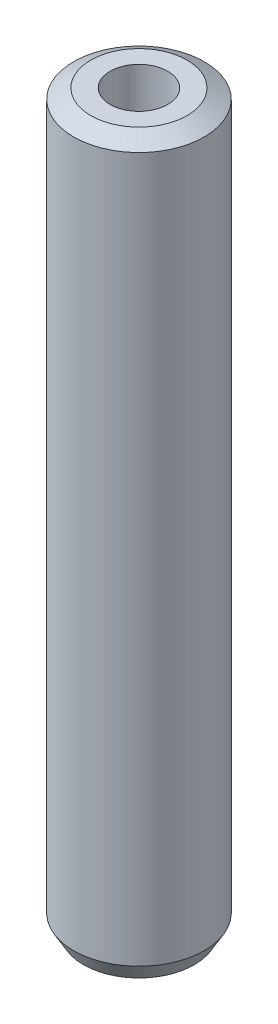
ISO-10303-21;
HEADER;
FILE_DESCRIPTION(('STEP AP214'),'2;1');
FILE_NAME('part.step','',(''),(''),'','','');
FILE_SCHEMA(('AUTOMOTIVE_DESIGN { 1 0 10303 214 1 1 1 1 }'));
ENDSEC;
DATA;
#1=APPLICATION_CONTEXT('core data for automotive mechanical design processes');
#2=APPLICATION_PROTOCOL_DEFINITION('international standard','automotive_design',2000,#1);
#3=PRODUCT_CONTEXT('',#1,'mechanical');
#4=PRODUCT('Part','Part','',(#3));
#5=PRODUCT_RELATED_PRODUCT_CATEGORY('part','',(#4));
#6=PRODUCT_DEFINITION_FORMATION('','',#4);
#7=PRODUCT_DEFINITION_CONTEXT('part definition',#1,'design');
#8=PRODUCT_DEFINITION('design','',#6,#7);
#9=PRODUCT_DEFINITION_SHAPE('','',#8);
#10=(LENGTH_UNIT() NAMED_UNIT(*) SI_UNIT(.MILLI.,.METRE.));
#11=(NAMED_UNIT(*) PLANE_ANGLE_UNIT() SI_UNIT($,.RADIAN.));
#12=(NAMED_UNIT(*) SI_UNIT($,.STERADIAN.) SOLID_ANGLE_UNIT());
#13=UNCERTAINTY_MEASURE_WITH_UNIT(LENGTH_MEASURE(1.E-05),#10,'distance_accuracy_value','');
#14=(GEOMETRIC_REPRESENTATION_CONTEXT(3) GLOBAL_UNCERTAINTY_ASSIGNED_CONTEXT((#13)) GLOBAL_UNIT_ASSIGNED_CONTEXT((#10,
#11,#12)) REPRESENTATION_CONTEXT('',''));
#15=CARTESIAN_POINT('',(0.,0.,0.));
#16=DIRECTION('',(0.,0.,1.));
#17=DIRECTION('',(1.,0.,0.));
#18=AXIS2_PLACEMENT_3D('',#15,#16,#17);
#19=CARTESIAN_POINT('',(0.,224.206713028779,0.));
#20=DIRECTION('',(0.,-1.,0.));
#21=DIRECTION('',(0.,0.,-1.));
#22=AXIS2_PLACEMENT_3D('',#19,#20,#21);
#23=CYLINDRICAL_SURFACE('',#22,20.);
#24=CARTESIAN_POINT('',(0.,221.171537849586,0.));
#25=DIRECTION('',(0.,1.,0.));
#26=DIRECTION('',(0.,0.,1.));
#27=AXIS2_PLACEMENT_3D('',#24,#25,#26);
#28=CIRCLE('',#27,20.);
#29=CARTESIAN_POINT('',(0.,221.171537849586,20.));
#30=VERTEX_POINT('',#29);
#31=EDGE_CURVE('E50',#30,#30,#28,.F.);
#32=ORIENTED_EDGE('',*,*,#31,.T.);
#33=EDGE_LOOP('',(#32));
#34=FACE_BOUND('',#33,.T.);
#35=CARTESIAN_POINT('',(0.,5.25707762023508,0.));
#36=DIRECTION('',(0.,1.,0.));
#37=DIRECTION('',(0.,0.,1.));
#38=AXIS2_PLACEMENT_3D('',#35,#36,#37);
#39=CIRCLE('',#38,20.);
#40=CARTESIAN_POINT('',(0.,5.25707762023508,20.));
#41=VERTEX_POINT('',#40);
#42=EDGE_CURVE('E51',#41,#41,#39,.T.);
#43=ORIENTED_EDGE('',*,*,#42,.T.);
#44=EDGE_LOOP('',(#43));
#45=FACE_BOUND('',#44,.T.);
#46=ADVANCED_FACE('F39',(#34,#45),#23,.T.);
#47=CARTESIAN_POINT('',(0.,224.206713028779,0.));
#48=DIRECTION('',(0.,1.,0.));
#49=DIRECTION('',(0.,0.,1.));
#50=AXIS2_PLACEMENT_3D('',#47,#48,#49);
#51=PLANE('',#50);
#52=CARTESIAN_POINT('',(0.,224.206713028779,0.));
#53=DIRECTION('',(0.,1.,0.));
#54=DIRECTION('',(0.,0.,1.));
#55=AXIS2_PLACEMENT_3D('',#52,#53,#54);
#56=CIRCLE('',#55,14.7429223797649);
#57=CARTESIAN_POINT('',(0.,224.206713028779,14.7429223797649));
#58=VERTEX_POINT('',#57);
#59=EDGE_CURVE('E54',#58,#58,#56,.T.);
#60=ORIENTED_EDGE('',*,*,#59,.T.);
#61=EDGE_LOOP('',(#60));
#62=FACE_BOUND('',#61,.T.);
#63=CARTESIAN_POINT('',(0.,224.206713028779,0.));
#64=DIRECTION('',(0.,1.,0.));
#65=DIRECTION('',(0.,0.,1.));
#66=AXIS2_PLACEMENT_3D('',#63,#64,#65);
#67=CIRCLE('',#66,8.83208812212423);
#68=CARTESIAN_POINT('',(0.,224.206713028779,8.83208812212423));
#69=VERTEX_POINT('',#68);
#70=EDGE_CURVE('E58',#69,#69,#67,.T.);
#71=ORIENTED_EDGE('',*,*,#70,.F.);
#72=EDGE_LOOP('',(#71));
#73=FACE_BOUND('',#72,.T.);
#74=ADVANCED_FACE('F69',(#62,#73),#51,.T.);
#75=CARTESIAN_POINT('',(0.,0.,0.));
#76=DIRECTION('',(0.,1.,0.));
#77=DIRECTION('',(0.,0.,1.));
#78=AXIS2_PLACEMENT_3D('',#75,#76,#77);
#79=PLANE('',#78);
#80=CARTESIAN_POINT('',(0.,0.,0.));
#81=DIRECTION('',(0.,1.,0.));
#82=DIRECTION('',(0.,0.,1.));
#83=AXIS2_PLACEMENT_3D('',#80,#81,#82);
#84=CIRCLE('',#83,16.9648248208065);
#85=CARTESIAN_POINT('',(0.,0.,16.9648248208065));
#86=VERTEX_POINT('',#85);
#87=EDGE_CURVE('E10',#86,#86,#84,.F.);
#88=ORIENTED_EDGE('',*,*,#87,.T.);
#89=EDGE_LOOP('',(#88));
#90=FACE_BOUND('',#89,.T.);
#91=CARTESIAN_POINT('',(0.,0.,0.));
#92=DIRECTION('',(0.,1.,0.));
#93=DIRECTION('',(0.,0.,1.));
#94=AXIS2_PLACEMENT_3D('',#91,#92,#93);
#95=CIRCLE('',#94,8.83208812212423);
#96=CARTESIAN_POINT('',(0.,0.,8.83208812212423));
#97=VERTEX_POINT('',#96);
#98=EDGE_CURVE('E63',#97,#97,#95,.T.);
#99=ORIENTED_EDGE('',*,*,#98,.T.);
#100=EDGE_LOOP('',(#99));
#101=FACE_BOUND('',#100,.T.);
#102=ADVANCED_FACE('F75',(#90,#101),#79,.F.);
#103=CARTESIAN_POINT('',(0.,224.206713028779,0.));
#104=DIRECTION('',(0.,-1.,0.));
#105=DIRECTION('',(0.,0.,-1.));
#106=AXIS2_PLACEMENT_3D('',#103,#104,#105);
#107=CYLINDRICAL_SURFACE('',#106,8.83208812212423);
#108=ORIENTED_EDGE('',*,*,#70,.T.);
#109=EDGE_LOOP('',(#108));
#110=FACE_BOUND('',#109,.T.);
#111=ORIENTED_EDGE('',*,*,#98,.F.);
#112=EDGE_LOOP('',(#111));
#113=FACE_BOUND('',#112,.T.);
#114=ADVANCED_FACE('F70',(#110,#113),#107,.F.);
#115=CARTESIAN_POINT('',(0.,224.206713028779,0.));
#116=DIRECTION('',(0.,-1.,0.));
#117=DIRECTION('',(0.,0.,-1.));
#118=AXIS2_PLACEMENT_3D('',#115,#116,#117);
#119=CONICAL_SURFACE('',#118,14.7429223797649,1.04719755119659);
#120=ORIENTED_EDGE('',*,*,#31,.F.);
#121=EDGE_LOOP('',(#120));
#122=FACE_BOUND('',#121,.T.);
#123=ORIENTED_EDGE('',*,*,#59,.F.);
#124=EDGE_LOOP('',(#123));
#125=FACE_BOUND('',#124,.T.);
#126=ADVANCED_FACE('F81',(#122,#125),#119,.T.);
#127=CARTESIAN_POINT('',(0.,5.25707762023508,0.));
#128=DIRECTION('',(0.,1.,0.));
#129=DIRECTION('',(0.,0.,1.));
#130=AXIS2_PLACEMENT_3D('',#127,#128,#129);
#131=CONICAL_SURFACE('',#130,20.,0.523598775598302);
#132=ORIENTED_EDGE('',*,*,#87,.F.);
#133=EDGE_LOOP('',(#132));
#134=FACE_BOUND('',#133,.T.);
#135=ORIENTED_EDGE('',*,*,#42,.F.);
#136=EDGE_LOOP('',(#135));
#137=FACE_BOUND('',#136,.T.);
#138=ADVANCED_FACE('F45',(#134,#137),#131,.T.);
#139=CLOSED_SHELL('',(#46,#74,#102,#114,#126,#138));
#140=MANIFOLD_SOLID_BREP('B2',#139);
#141=ADVANCED_BREP_SHAPE_REPRESENTATION('',(#18,#140),#14);
#142=SHAPE_DEFINITION_REPRESENTATION(#9,#141);
ENDSEC;
END-ISO-10303-21;
